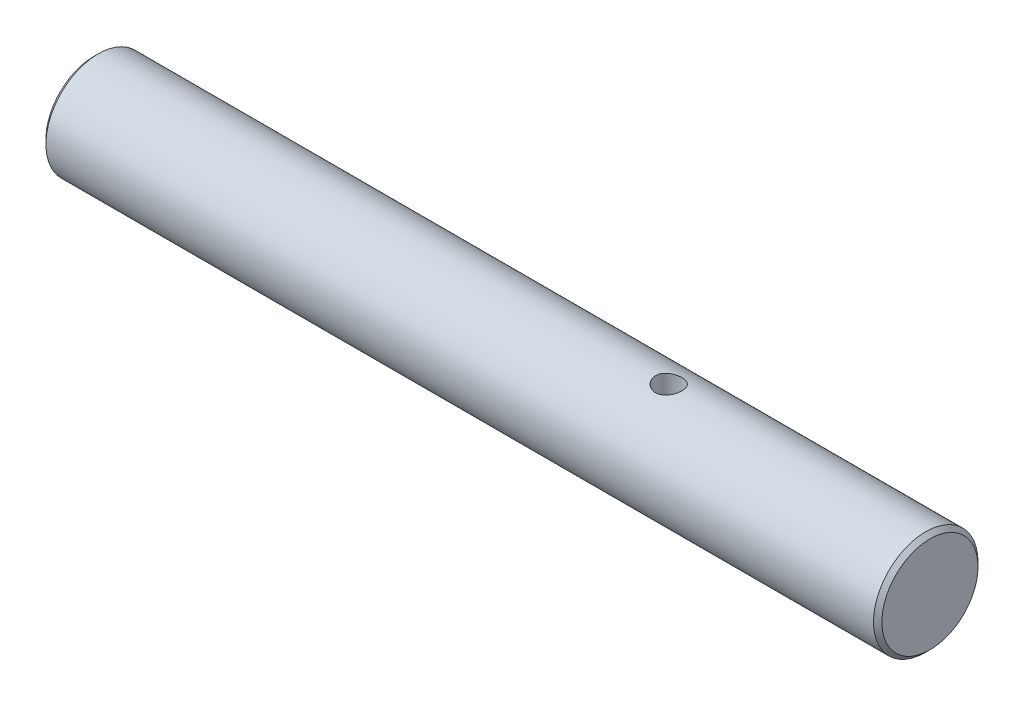
ISO-10303-21;
HEADER;
FILE_DESCRIPTION(('STEP AP214'),'2;1');
FILE_NAME('part.step','',(''),(''),'','','');
FILE_SCHEMA(('AUTOMOTIVE_DESIGN { 1 0 10303 214 1 1 1 1 }'));
ENDSEC;
DATA;
#1=APPLICATION_CONTEXT('core data for automotive mechanical design processes');
#2=APPLICATION_PROTOCOL_DEFINITION('international standard','automotive_design',2000,#1);
#3=PRODUCT_CONTEXT('',#1,'mechanical');
#4=PRODUCT('Part','Part','',(#3));
#5=PRODUCT_RELATED_PRODUCT_CATEGORY('part','',(#4));
#6=PRODUCT_DEFINITION_FORMATION('','',#4);
#7=PRODUCT_DEFINITION_CONTEXT('part definition',#1,'design');
#8=PRODUCT_DEFINITION('design','',#6,#7);
#9=PRODUCT_DEFINITION_SHAPE('','',#8);
#10=(LENGTH_UNIT() NAMED_UNIT(*) SI_UNIT(.MILLI.,.METRE.));
#11=(NAMED_UNIT(*) PLANE_ANGLE_UNIT() SI_UNIT($,.RADIAN.));
#12=(NAMED_UNIT(*) SI_UNIT($,.STERADIAN.) SOLID_ANGLE_UNIT());
#13=UNCERTAINTY_MEASURE_WITH_UNIT(LENGTH_MEASURE(1.E-05),#10,'distance_accuracy_value','');
#14=(GEOMETRIC_REPRESENTATION_CONTEXT(3) GLOBAL_UNCERTAINTY_ASSIGNED_CONTEXT((#13)) GLOBAL_UNIT_ASSIGNED_CONTEXT((#10,
#11,#12)) REPRESENTATION_CONTEXT('',''));
#15=CARTESIAN_POINT('',(0.,0.,0.));
#16=DIRECTION('',(0.,0.,1.));
#17=DIRECTION('',(1.,0.,0.));
#18=AXIS2_PLACEMENT_3D('',#15,#16,#17);
#19=CARTESIAN_POINT('',(-50.8,0.,0.));
#20=DIRECTION('',(1.,0.,0.));
#21=DIRECTION('',(0.,0.,-1.));
#22=AXIS2_PLACEMENT_3D('',#19,#20,#21);
#23=CYLINDRICAL_SURFACE('',#22,3.175);
#24=CARTESIAN_POINT('',(-15.0749,-3.175,0.));
#25=CARTESIAN_POINT('',(-15.0749012192326,-3.17499926061919,0.044194558615329));
#26=CARTESIAN_POINT('',(-15.0785740287583,-3.17406806749438,0.0884026685134962));
#27=CARTESIAN_POINT('',(-15.0931457555988,-3.17044360804568,0.175551121080481));
#28=CARTESIAN_POINT('',(-15.1040486960238,-3.16774936070479,0.218490744013717));
#29=CARTESIAN_POINT('',(-15.1327080596752,-3.16089702486516,0.301831200982996));
#30=CARTESIAN_POINT('',(-15.1504561813665,-3.15674071003248,0.34223504155801));
#31=CARTESIAN_POINT('',(-15.1922727137159,-3.14740649025808,0.419491994408565));
#32=CARTESIAN_POINT('',(-15.2163413623341,-3.14222854685513,0.456344972927149));
#33=CARTESIAN_POINT('',(-15.2706470530135,-3.13129183973811,0.526224337624056));
#34=CARTESIAN_POINT('',(-15.3009913725137,-3.12552400001613,0.559165938248033));
#35=CARTESIAN_POINT('',(-15.3667574018589,-3.11411763042046,0.619550450328698));
#36=CARTESIAN_POINT('',(-15.4021796932234,-3.10847911544268,0.64699273114974));
#37=CARTESIAN_POINT('',(-15.4777566379964,-3.09787815057358,0.69600008056985));
#38=CARTESIAN_POINT('',(-15.5179747585885,-3.09292721458745,0.717469990190073));
#39=CARTESIAN_POINT('',(-15.6015943665704,-3.08439445829358,0.75331107860638));
#40=CARTESIAN_POINT('',(-15.6449953347003,-3.08081241524987,0.767683412377865));
#41=CARTESIAN_POINT('',(-15.7328155539105,-3.07551634735535,0.788631519909633));
#42=CARTESIAN_POINT('',(-15.7771961526226,-3.07376581834439,0.795359890352631));
#43=CARTESIAN_POINT('',(-15.8664880592988,-3.07222173589316,0.801304443009542));
#44=CARTESIAN_POINT('',(-15.9113992782155,-3.0724278586232,0.800521868299323));
#45=CARTESIAN_POINT('',(-15.9993055352324,-3.07474099351563,0.791588424618985));
#46=CARTESIAN_POINT('',(-16.042320515769,-3.07680100843036,0.783619718053222));
#47=CARTESIAN_POINT('',(-16.1263824930664,-3.08251487674085,0.760830938475984));
#48=CARTESIAN_POINT('',(-16.1674293473854,-3.08616884530523,0.746010370389318));
#49=CARTESIAN_POINT('',(-16.2468767679294,-3.09470183518732,0.709784130628984));
#50=CARTESIAN_POINT('',(-16.2852459487121,-3.09959301241528,0.6883126114905));
#51=CARTESIAN_POINT('',(-16.3579018707644,-3.1100424831046,0.639440005835741));
#52=CARTESIAN_POINT('',(-16.3921878854377,-3.11560089494752,0.612037866407233));
#53=CARTESIAN_POINT('',(-16.4567477611494,-3.12695616041351,0.551139708525976));
#54=CARTESIAN_POINT('',(-16.4868764912911,-3.13275525500816,0.517490054895695));
#55=CARTESIAN_POINT('',(-16.5410911437239,-3.14379325801761,0.445546166570213));
#56=CARTESIAN_POINT('',(-16.5651768755484,-3.14903214877261,0.407251785536343));
#57=CARTESIAN_POINT('',(-16.6066763486564,-3.15838622444288,0.326896340185273));
#58=CARTESIAN_POINT('',(-16.6240662020502,-3.16249737135033,0.284822438451066));
#59=CARTESIAN_POINT('',(-16.6514856253308,-3.16910340089186,0.198221723445971));
#60=CARTESIAN_POINT('',(-16.6615166264302,-3.17159859779863,0.153695388957168));
#61=CARTESIAN_POINT('',(-16.6737112297412,-3.17464495997288,0.0646943274563268));
#62=CARTESIAN_POINT('',(-16.6760724329013,-3.17524494120777,0.0202483059449408));
#63=CARTESIAN_POINT('',(-16.6734028175583,-3.17457246064335,-0.0684039206917929));
#64=CARTESIAN_POINT('',(-16.6683726758745,-3.17330017028643,-0.112610147402936));
#65=CARTESIAN_POINT('',(-16.6512259453605,-3.16905741507741,-0.198839104279927));
#66=CARTESIAN_POINT('',(-16.639217438855,-3.16611286597304,-0.240884717578269));
#67=CARTESIAN_POINT('',(-16.6085785508337,-3.15885771002344,-0.322362309386602));
#68=CARTESIAN_POINT('',(-16.5899474944187,-3.15454696395491,-0.361794021029634));
#69=CARTESIAN_POINT('',(-16.5462113450995,-3.14492096545913,-0.437708527148821));
#70=CARTESIAN_POINT('',(-16.5209959478682,-3.13958905668079,-0.474125609611463));
#71=CARTESIAN_POINT('',(-16.4649476077615,-3.12853797087064,-0.54228157627721));
#72=CARTESIAN_POINT('',(-16.4341136789975,-3.12281872598345,-0.574019637677332));
#73=CARTESIAN_POINT('',(-16.3667854891433,-3.11146138201156,-0.632733099761772));
#74=CARTESIAN_POINT('',(-16.3301691147648,-3.10582887507164,-0.659569788448509));
#75=CARTESIAN_POINT('',(-16.2528363077356,-3.0954418007527,-0.7067178848178));
#76=CARTESIAN_POINT('',(-16.2121200564534,-3.09068719456386,-0.72702958098352));
#77=CARTESIAN_POINT('',(-16.1279603632697,-3.08264697495578,-0.760399482295295));
#78=CARTESIAN_POINT('',(-16.0845348216483,-3.07935268742908,-0.773500632643829));
#79=CARTESIAN_POINT('',(-15.9960015824923,-3.07459842402389,-0.792189542961761));
#80=CARTESIAN_POINT('',(-15.9508942622207,-3.07313803927642,-0.797778977689176));
#81=CARTESIAN_POINT('',(-15.8616904129164,-3.07224845084114,-0.801197231842083));
#82=CARTESIAN_POINT('',(-15.8176028289329,-3.07276118203122,-0.799247894762021));
#83=CARTESIAN_POINT('',(-15.7304067603455,-3.07562560581448,-0.788152468719857));
#84=CARTESIAN_POINT('',(-15.6872982554684,-3.07797726029449,-0.779006528913149));
#85=CARTESIAN_POINT('',(-15.6035296832745,-3.08422193358051,-0.75389957508709));
#86=CARTESIAN_POINT('',(-15.5628561934747,-3.08810538809145,-0.737980801869031));
#87=CARTESIAN_POINT('',(-15.4847280381596,-3.09697730115477,-0.699813386650078));
#88=CARTESIAN_POINT('',(-15.4472738271288,-3.10196591537456,-0.677563852803376));
#89=CARTESIAN_POINT('',(-15.3755769264148,-3.11265110668571,-0.626673714409328));
#90=CARTESIAN_POINT('',(-15.3414455414282,-3.11836293275759,-0.597879474387623));
#91=CARTESIAN_POINT('',(-15.2784269237736,-3.12976064187187,-0.535015840835662));
#92=CARTESIAN_POINT('',(-15.2495409413052,-3.13544651841542,-0.500945193291906));
#93=CARTESIAN_POINT('',(-15.1973119956564,-3.14627712643702,-0.427735831864607));
#94=CARTESIAN_POINT('',(-15.1740813546151,-3.15140991323625,-0.388515082759617));
#95=CARTESIAN_POINT('',(-15.1345801613398,-3.16042948515729,-0.306598877697786));
#96=CARTESIAN_POINT('',(-15.1183046818311,-3.16431715187398,-0.263905907189162));
#97=CARTESIAN_POINT('',(-15.0955577242808,-3.16984205709644,-0.184415357963877));
#98=CARTESIAN_POINT('',(-15.087827965283,-3.17176290620974,-0.147992420787638));
#99=CARTESIAN_POINT('',(-15.077498789471,-3.17434213973988,-0.0743828157800313));
#100=CARTESIAN_POINT('',(-15.0748989738368,-3.17500062229747,-0.0371962075462955));
#101=CARTESIAN_POINT('',(-15.0749,-3.175,0.));
#102=B_SPLINE_CURVE_WITH_KNOTS('',3,(#24,#25,#26,#27,#28,#29,#30,#31,#32,#33,#34,#35,#36,#37,
#38,#39,#40,#41,#42,#43,#44,#45,#46,#47,#48,#49,#50,#51,#52,#53,#54,#55,#56,#57,#58,#59,#60,#61,
#62,#63,#64,#65,#66,#67,#68,#69,#70,#71,#72,#73,#74,#75,#76,#77,#78,#79,#80,#81,#82,#83,#84,#85,
#86,#87,#88,#89,#90,#91,#92,#93,#94,#95,#96,#97,#98,#99,#100,#101),.UNSPECIFIED.,.T.,.F.,(4,2,2,
2,2,2,2,2,2,2,2,2,2,2,2,2,2,2,2,2,2,2,2,2,2,2,2,2,2,2,2,2,2,2,2,2,2,2,4),(0.,0.132447354071684,
0.264968468619232,0.397329370188534,0.52969525569568,0.664545055282163,0.799410309959517,
0.936315166227553,1.07319773687421,1.20729686173983,1.34137379332515,1.47214467066986,
1.60292499822566,1.73504389286222,1.86718626293194,2.00315952635134,2.139137074913,
2.27559533237844,2.41202704323488,2.5449146955339,2.67779018017591,2.80866052908661,
2.9395442187261,3.07277948800678,3.20603815875274,3.34262429115238,3.47920438397045,
3.61496196666796,3.75068927680842,3.88245336221338,4.01421471677338,4.145166078079,
4.27613589629705,4.41057382248032,4.54504374892683,4.68199913280024,4.81885733129726,
4.93033988654635,5.0418137744041),.UNSPECIFIED.);
#103=CARTESIAN_POINT('',(-15.0749,-3.175,0.));
#104=VERTEX_POINT('',#103);
#105=EDGE_CURVE('E10',#104,#104,#102,.T.);
#106=ORIENTED_EDGE('',*,*,#105,.F.);
#107=EDGE_LOOP('',(#106));
#108=FACE_BOUND('',#107,.T.);
#109=CARTESIAN_POINT('',(-15.875,3.07253396889278,0.8001));
#110=CARTESIAN_POINT('',(-15.8308305672585,3.0725348051082,0.80009876608396));
#111=CARTESIAN_POINT('',(-15.7866475523915,3.07349681294689,0.796429988216414));
#112=CARTESIAN_POINT('',(-15.6995511578479,3.07723087527521,0.781875724183331));
#113=CARTESIAN_POINT('',(-15.6566385197715,3.08000396604764,0.770986106273648));
#114=CARTESIAN_POINT('',(-15.5733552955042,3.08702663169601,0.742365674066662));
#115=CARTESIAN_POINT('',(-15.5329814732543,3.09127428006682,0.724643782790454));
#116=CARTESIAN_POINT('',(-15.4557753772485,3.10076505222951,0.682889132424946));
#117=CARTESIAN_POINT('',(-15.4189432687616,3.10600822244208,0.658856079029204));
#118=CARTESIAN_POINT('',(-15.3490427034007,3.11703050169978,0.604587336015973));
#119=CARTESIAN_POINT('',(-15.3160651058038,3.1228182852127,0.5742363543937));
#120=CARTESIAN_POINT('',(-15.2556104476428,3.1342024484424,0.508441593428325));
#121=CARTESIAN_POINT('',(-15.2281339076589,3.13979881000288,0.472997332638834));
#122=CARTESIAN_POINT('',(-15.1790887517436,3.15026563982044,0.397398807294971));
#123=CARTESIAN_POINT('',(-15.157609519229,3.15512467848743,0.357184835065325));
#124=CARTESIAN_POINT('',(-15.1217500781348,3.16347035165026,0.273574109685516));
#125=CARTESIAN_POINT('',(-15.1073688047817,3.16695719197537,0.230177835038971));
#126=CARTESIAN_POINT('',(-15.0864048936885,3.17210427187305,0.142381715626149));
#127=CARTESIAN_POINT('',(-15.0796679311182,3.17380060737892,0.0980208732345284));
#128=CARTESIAN_POINT('',(-15.0736993317476,3.17530138089332,0.00876837200928309));
#129=CARTESIAN_POINT('',(-15.0744665681941,3.17510610292711,-0.0361232061235494));
#130=CARTESIAN_POINT('',(-15.0833738651718,3.17287247229481,-0.124092092626158));
#131=CARTESIAN_POINT('',(-15.0913473286862,3.17087576768535,-0.167187486725854));
#132=CARTESIAN_POINT('',(-15.1141727991222,3.16531220584472,-0.251407740714446));
#133=CARTESIAN_POINT('',(-15.1290251754708,3.1617452642856,-0.292532494640615));
#134=CARTESIAN_POINT('',(-15.165320824012,3.15337852921137,-0.372081404316347));
#135=CARTESIAN_POINT('',(-15.1868231254213,3.14856776001674,-0.410477425105128));
#136=CARTESIAN_POINT('',(-15.2357634129958,3.13823480239744,-0.483174376361823));
#137=CARTESIAN_POINT('',(-15.2632024466213,3.13271248849945,-0.517474582516192));
#138=CARTESIAN_POINT('',(-15.324129371882,3.12137870903818,-0.581999914997204));
#139=CARTESIAN_POINT('',(-15.3577628117916,3.11556346791151,-0.612087095596401));
#140=CARTESIAN_POINT('',(-15.4296586440963,3.10443793195679,-0.666225302222772));
#141=CARTESIAN_POINT('',(-15.467921259912,3.09912766152255,-0.690276036737161));
#142=CARTESIAN_POINT('',(-15.5482632249244,3.08959960327955,-0.731748883874923));
#143=CARTESIAN_POINT('',(-15.5903606826335,3.08538740444006,-0.749137289300718));
#144=CARTESIAN_POINT('',(-15.6770132487871,3.07860382582511,-0.776546858345657));
#145=CARTESIAN_POINT('',(-15.7215678194291,3.0760320885288,-0.78656962729809));
#146=CARTESIAN_POINT('',(-15.810589316992,3.07289578590832,-0.798733500138195));
#147=CARTESIAN_POINT('',(-15.8550265470909,3.07227923911193,-0.801078776861646));
#148=CARTESIAN_POINT('',(-15.9436575894475,3.07298154579149,-0.79838047392185));
#149=CARTESIAN_POINT('',(-15.9878514241246,3.0743002179154,-0.793337586613739));
#150=CARTESIAN_POINT('',(-16.0739797054792,3.078674523571,-0.776185241982357));
#151=CARTESIAN_POINT('',(-16.1159395483724,3.08170080558703,-0.764195107307213));
#152=CARTESIAN_POINT('',(-16.1972536070939,3.08912138373645,-0.733621139693018));
#153=CARTESIAN_POINT('',(-16.2366075097886,3.09351584391164,-0.715036516050668));
#154=CARTESIAN_POINT('',(-16.3124563945191,3.10328675549971,-0.671375278486681));
#155=CARTESIAN_POINT('',(-16.3488789115875,3.10868100608242,-0.646176849375096));
#156=CARTESIAN_POINT('',(-16.4170535388242,3.11980024567038,-0.590156963316061));
#157=CARTESIAN_POINT('',(-16.4488048669868,3.12552528983102,-0.559334566788143));
#158=CARTESIAN_POINT('',(-16.5075652752706,3.1368375442012,-0.492003797605879));
#159=CARTESIAN_POINT('',(-16.5344329804822,3.14241753035757,-0.455370603384024));
#160=CARTESIAN_POINT('',(-16.5816355826269,3.15266017208134,-0.37799409525176));
#161=CARTESIAN_POINT('',(-16.6019708216732,3.15732287568298,-0.337250996728904));
#162=CARTESIAN_POINT('',(-16.6353533425045,3.16517608708767,-0.253093808281745));
#163=CARTESIAN_POINT('',(-16.648453333548,3.16837721210682,-0.20970166415928));
#164=CARTESIAN_POINT('',(-16.6671511626675,3.17299309716398,-0.121240327413036));
#165=CARTESIAN_POINT('',(-16.672750473423,3.17440820786392,-0.0761714657815543));
#166=CARTESIAN_POINT('',(-16.6762040473025,3.17527804356187,0.0130366929719295));
#167=CARTESIAN_POINT('',(-16.6742667970396,3.17478554122156,0.0571675254998983));
#168=CARTESIAN_POINT('',(-16.6631805391684,3.17201278591017,0.144453392991355));
#169=CARTESIAN_POINT('',(-16.6540317523715,3.16973258767686,0.187608457790416));
#170=CARTESIAN_POINT('',(-16.6288946759822,3.16364908220415,0.271495733854131));
#171=CARTESIAN_POINT('',(-16.6129446269524,3.15985429834767,0.31224006253659));
#172=CARTESIAN_POINT('',(-16.574692400912,3.15114088344559,0.390497311080539));
#173=CARTESIAN_POINT('',(-16.5523894119771,3.14622210876655,0.428009817106926));
#174=CARTESIAN_POINT('',(-16.5014315667621,3.13564137420049,0.499725063525822));
#175=CARTESIAN_POINT('',(-16.4726356294112,3.12996426893402,0.533825322892189));
#176=CARTESIAN_POINT('',(-16.4097824662886,3.1185740164936,0.596780398276611));
#177=CARTESIAN_POINT('',(-16.3757239031007,3.11286086051291,0.625633876836479));
#178=CARTESIAN_POINT('',(-16.30253186578,3.10192138340788,0.677816154241447));
#179=CARTESIAN_POINT('',(-16.2633141251648,3.09670640036459,0.701029325715569));
#180=CARTESIAN_POINT('',(-16.1814068362831,3.08750714520526,0.740498623876105));
#181=CARTESIAN_POINT('',(-16.1387198111394,3.08352198860927,0.756759753666212));
#182=CARTESIAN_POINT('',(-16.05926424991,3.0778483901463,0.779476362570762));
#183=CARTESIAN_POINT('',(-16.0228719317288,3.07587060885164,0.787193219392023));
#184=CARTESIAN_POINT('',(-15.949322902682,3.07321310375089,0.797505330997217));
#185=CARTESIAN_POINT('',(-15.9121662596438,3.07253326526138,0.800101038275592));
#186=CARTESIAN_POINT('',(-15.875,3.07253396889278,0.8001));
#187=B_SPLINE_CURVE_WITH_KNOTS('',3,(#109,#110,#111,#112,#113,#114,#115,#116,#117,#118,#119,
#120,#121,#122,#123,#124,#125,#126,#127,#128,#129,#130,#131,#132,#133,#134,#135,#136,#137,#138,
#139,#140,#141,#142,#143,#144,#145,#146,#147,#148,#149,#150,#151,#152,#153,#154,#155,#156,#157,
#158,#159,#160,#161,#162,#163,#164,#165,#166,#167,#168,#169,#170,#171,#172,#173,#174,#175,#176,
#177,#178,#179,#180,#181,#182,#183,#184,#185,#186),.UNSPECIFIED.,.T.,.F.,(4,2,2,2,2,2,2,2,2,2,2,
2,2,2,2,2,2,2,2,2,2,2,2,2,2,2,2,2,2,2,2,2,2,2,2,2,2,2,4),(0.,0.132371791473475,
0.264819391145222,0.397094595650513,0.529375969599578,0.664324502713228,0.799285800348928,
0.936162550045837,1.07301876044725,1.20705999107345,1.34108109575677,1.4720809347437,
1.6030878097993,1.73529269283765,1.86752092078446,2.00338412742358,2.13925389392323,
2.27580227382503,2.41232088430719,2.54517813851154,2.67802294327399,2.80865099299603,
2.93929471079365,3.07253788155873,3.20580333330295,3.342462890599,3.47911528970157,
3.61475857455171,3.75037522336786,3.882267296098,4.01415533056015,4.14531139561969,
4.27648423033722,4.41084208473558,4.5452341404627,4.68218456357767,4.81903626241781,
4.93043002105086,5.04181393671525),.UNSPECIFIED.);
#188=CARTESIAN_POINT('',(-15.875,3.07253396889278,0.8001));
#189=VERTEX_POINT('',#188);
#190=EDGE_CURVE('E40',#189,#189,#187,.T.);
#191=ORIENTED_EDGE('',*,*,#190,.F.);
#192=EDGE_LOOP('',(#191));
#193=FACE_BOUND('',#192,.T.);
#194=CARTESIAN_POINT('',(-50.546,0.,0.));
#195=DIRECTION('',(1.,0.,0.));
#196=DIRECTION('',(0.,0.,-1.));
#197=AXIS2_PLACEMENT_3D('',#194,#195,#196);
#198=CIRCLE('',#197,3.175);
#199=CARTESIAN_POINT('',(-50.546,0.,-3.175));
#200=VERTEX_POINT('',#199);
#201=EDGE_CURVE('E82',#200,#200,#198,.T.);
#202=ORIENTED_EDGE('',*,*,#201,.T.);
#203=EDGE_LOOP('',(#202));
#204=FACE_BOUND('',#203,.T.);
#205=CARTESIAN_POINT('',(-0.254000000000004,0.,0.));
#206=DIRECTION('',(1.,0.,0.));
#207=DIRECTION('',(0.,0.,-1.));
#208=AXIS2_PLACEMENT_3D('',#205,#206,#207);
#209=CIRCLE('',#208,3.175);
#210=CARTESIAN_POINT('',(-0.254000000000004,0.,-3.175));
#211=VERTEX_POINT('',#210);
#212=EDGE_CURVE('E85',#211,#211,#209,.F.);
#213=ORIENTED_EDGE('',*,*,#212,.T.);
#214=EDGE_LOOP('',(#213));
#215=FACE_BOUND('',#214,.T.);
#216=ADVANCED_FACE('F29',(#108,#193,#204,#215),#23,.T.);
#217=CARTESIAN_POINT('',(-50.8,0.,0.));
#218=DIRECTION('',(1.,0.,0.));
#219=DIRECTION('',(0.,0.,-1.));
#220=AXIS2_PLACEMENT_3D('',#217,#218,#219);
#221=PLANE('',#220);
#222=CARTESIAN_POINT('',(-50.8,0.,0.));
#223=DIRECTION('',(1.,0.,0.));
#224=DIRECTION('',(0.,0.,-1.));
#225=AXIS2_PLACEMENT_3D('',#222,#223,#224);
#226=CIRCLE('',#225,2.92100000000001);
#227=CARTESIAN_POINT('',(-50.8,0.,-2.92100000000001));
#228=VERTEX_POINT('',#227);
#229=EDGE_CURVE('E48',#228,#228,#226,.F.);
#230=ORIENTED_EDGE('',*,*,#229,.T.);
#231=EDGE_LOOP('',(#230));
#232=FACE_BOUND('',#231,.T.);
#233=ADVANCED_FACE('F59',(#232),#221,.F.);
#234=CARTESIAN_POINT('',(0.,0.,0.));
#235=DIRECTION('',(1.,0.,0.));
#236=DIRECTION('',(0.,0.,-1.));
#237=AXIS2_PLACEMENT_3D('',#234,#235,#236);
#238=PLANE('',#237);
#239=CARTESIAN_POINT('',(0.,0.,0.));
#240=DIRECTION('',(1.,0.,0.));
#241=DIRECTION('',(0.,0.,-1.));
#242=AXIS2_PLACEMENT_3D('',#239,#240,#241);
#243=CIRCLE('',#242,2.921);
#244=CARTESIAN_POINT('',(0.,0.,-2.921));
#245=VERTEX_POINT('',#244);
#246=EDGE_CURVE('E44',#245,#245,#243,.T.);
#247=ORIENTED_EDGE('',*,*,#246,.T.);
#248=EDGE_LOOP('',(#247));
#249=FACE_BOUND('',#248,.T.);
#250=ADVANCED_FACE('F62',(#249),#238,.T.);
#251=CARTESIAN_POINT('',(-50.546,0.,0.));
#252=DIRECTION('',(1.,0.,0.));
#253=DIRECTION('',(0.,0.,-1.));
#254=AXIS2_PLACEMENT_3D('',#251,#252,#253);
#255=CONICAL_SURFACE('',#254,3.175,0.78539816339744);
#256=ORIENTED_EDGE('',*,*,#229,.F.);
#257=EDGE_LOOP('',(#256));
#258=FACE_BOUND('',#257,.T.);
#259=ORIENTED_EDGE('',*,*,#201,.F.);
#260=EDGE_LOOP('',(#259));
#261=FACE_BOUND('',#260,.T.);
#262=ADVANCED_FACE('F65',(#258,#261),#255,.T.);
#263=CARTESIAN_POINT('',(0.,0.,0.));
#264=DIRECTION('',(-1.,0.,0.));
#265=DIRECTION('',(0.,0.,1.));
#266=AXIS2_PLACEMENT_3D('',#263,#264,#265);
#267=CONICAL_SURFACE('',#266,2.921,0.78539816339744);
#268=ORIENTED_EDGE('',*,*,#212,.F.);
#269=EDGE_LOOP('',(#268));
#270=FACE_BOUND('',#269,.T.);
#271=ORIENTED_EDGE('',*,*,#246,.F.);
#272=EDGE_LOOP('',(#271));
#273=FACE_BOUND('',#272,.T.);
#274=ADVANCED_FACE('F31',(#270,#273),#267,.T.);
#275=CARTESIAN_POINT('',(-15.875,-3.175,0.));
#276=DIRECTION('',(0.,1.,0.));
#277=DIRECTION('',(0.,0.,1.));
#278=AXIS2_PLACEMENT_3D('',#275,#276,#277);
#279=CYLINDRICAL_SURFACE('',#278,0.8001);
#280=ORIENTED_EDGE('',*,*,#105,.T.);
#281=EDGE_LOOP('',(#280));
#282=FACE_BOUND('',#281,.T.);
#283=ORIENTED_EDGE('',*,*,#190,.T.);
#284=EDGE_LOOP('',(#283));
#285=FACE_BOUND('',#284,.T.);
#286=ADVANCED_FACE('F55',(#282,#285),#279,.F.);
#287=CLOSED_SHELL('',(#216,#233,#250,#262,#274,#286));
#288=MANIFOLD_SOLID_BREP('B2',#287);
#289=ADVANCED_BREP_SHAPE_REPRESENTATION('',(#18,#288),#14);
#290=SHAPE_DEFINITION_REPRESENTATION(#9,#289);
ENDSEC;
END-ISO-10303-21;
